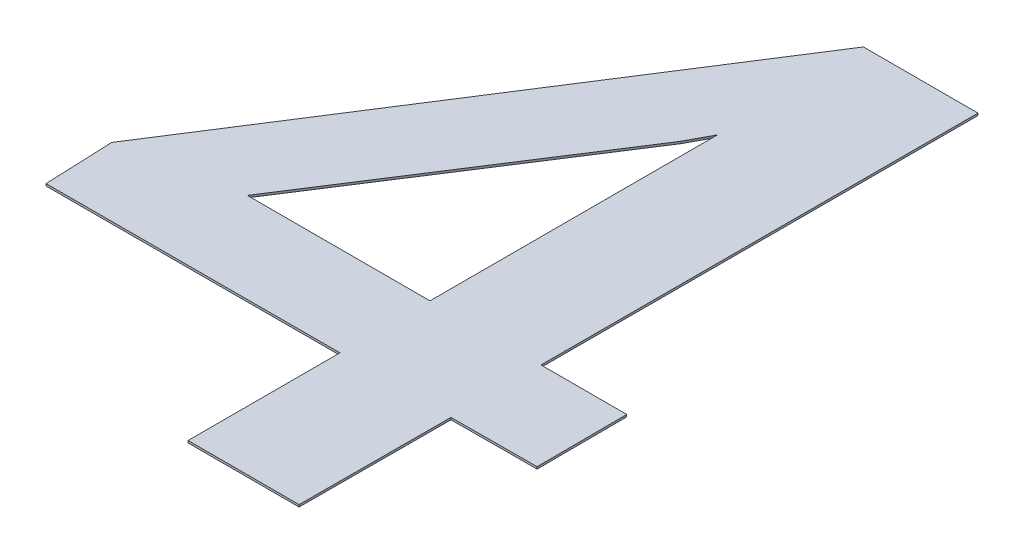
ISO-10303-21;
HEADER;
FILE_DESCRIPTION(('STEP AP214'),'2;1');
FILE_NAME('part.step','',(''),(''),'','','');
FILE_SCHEMA(('AUTOMOTIVE_DESIGN { 1 0 10303 214 1 1 1 1 }'));
ENDSEC;
DATA;
#1=APPLICATION_CONTEXT('core data for automotive mechanical design processes');
#2=APPLICATION_PROTOCOL_DEFINITION('international standard','automotive_design',2000,#1);
#3=PRODUCT_CONTEXT('',#1,'mechanical');
#4=PRODUCT('Part','Part','',(#3));
#5=PRODUCT_RELATED_PRODUCT_CATEGORY('part','',(#4));
#6=PRODUCT_DEFINITION_FORMATION('','',#4);
#7=PRODUCT_DEFINITION_CONTEXT('part definition',#1,'design');
#8=PRODUCT_DEFINITION('design','',#6,#7);
#9=PRODUCT_DEFINITION_SHAPE('','',#8);
#10=(LENGTH_UNIT() NAMED_UNIT(*) SI_UNIT(.MILLI.,.METRE.));
#11=(NAMED_UNIT(*) PLANE_ANGLE_UNIT() SI_UNIT($,.RADIAN.));
#12=(NAMED_UNIT(*) SI_UNIT($,.STERADIAN.) SOLID_ANGLE_UNIT());
#13=UNCERTAINTY_MEASURE_WITH_UNIT(LENGTH_MEASURE(1.E-05),#10,'distance_accuracy_value','');
#14=(GEOMETRIC_REPRESENTATION_CONTEXT(3) GLOBAL_UNCERTAINTY_ASSIGNED_CONTEXT((#13)) GLOBAL_UNIT_ASSIGNED_CONTEXT((#10,
#11,#12)) REPRESENTATION_CONTEXT('',''));
#15=CARTESIAN_POINT('',(0.,0.,0.));
#16=DIRECTION('',(0.,0.,1.));
#17=DIRECTION('',(1.,0.,0.));
#18=AXIS2_PLACEMENT_3D('',#15,#16,#17);
#19=CARTESIAN_POINT('',(-11.16231131397,6.01,9.773928150074));
#20=DIRECTION('',(-0.840562114855149,0.,-0.541715175226096));
#21=DIRECTION('',(-0.541715175226096,0.,0.840562114855149));
#22=AXIS2_PLACEMENT_3D('',#19,#20,#21);
#23=PLANE('',#22);
#24=DIRECTION('',(0.541715175226096,0.,-0.840562114855149));
#25=VECTOR('',#24,1.);
#26=CARTESIAN_POINT('',(-11.16231131397,6.,9.773928150074));
#27=LINE('',#26,#25);
#28=CARTESIAN_POINT('',(-11.16231131397,6.,9.773928150074));
#29=VERTEX_POINT('',#28);
#30=CARTESIAN_POINT('',(-10.36823825739,6.,8.541790380437));
#31=VERTEX_POINT('',#30);
#32=EDGE_CURVE('E144',#29,#31,#27,.T.);
#33=ORIENTED_EDGE('',*,*,#32,.T.);
#34=DIRECTION('',(0.,-1.,0.));
#35=VECTOR('',#34,1.);
#36=CARTESIAN_POINT('',(-10.36823825739,6.01,8.541790380437));
#37=LINE('',#36,#35);
#38=CARTESIAN_POINT('',(-10.36823825739,6.01,8.541790380437));
#39=VERTEX_POINT('',#38);
#40=EDGE_CURVE('E11',#39,#31,#37,.T.);
#41=ORIENTED_EDGE('',*,*,#40,.F.);
#42=DIRECTION('',(0.541715175226096,0.,-0.840562114855149));
#43=VECTOR('',#42,1.);
#44=CARTESIAN_POINT('',(-11.16231131397,6.01,9.773928150074));
#45=LINE('',#44,#43);
#46=CARTESIAN_POINT('',(-11.16231131397,6.01,9.773928150074));
#47=VERTEX_POINT('',#46);
#48=EDGE_CURVE('E146',#47,#39,#45,.T.);
#49=ORIENTED_EDGE('',*,*,#48,.F.);
#50=DIRECTION('',(0.,-1.,0.));
#51=VECTOR('',#50,1.);
#52=CARTESIAN_POINT('',(-11.16231131397,6.01,9.773928150074));
#53=LINE('',#52,#51);
#54=EDGE_CURVE('E118',#47,#29,#53,.T.);
#55=ORIENTED_EDGE('',*,*,#54,.T.);
#56=EDGE_LOOP('',(#33,#41,#49,#55));
#57=FACE_BOUND('',#56,.T.);
#58=ADVANCED_FACE('F16',(#57),#23,.F.);
#59=CARTESIAN_POINT('',(-10.36823825739,6.01,8.541790380437));
#60=DIRECTION('',(-0.880955569015077,0.,-0.473198991357042));
#61=DIRECTION('',(-0.473198991357042,0.,0.880955569015077));
#62=AXIS2_PLACEMENT_3D('',#59,#60,#61);
#63=PLANE('',#62);
#64=DIRECTION('',(0.473198991357042,0.,-0.880955569015077));
#65=VECTOR('',#64,1.);
#66=CARTESIAN_POINT('',(-10.36823825739,6.,8.541790380437));
#67=LINE('',#66,#65);
#68=CARTESIAN_POINT('',(-10.30750362166,6.,8.428720579867));
#69=VERTEX_POINT('',#68);
#70=EDGE_CURVE('E150',#31,#69,#67,.T.);
#71=ORIENTED_EDGE('',*,*,#70,.T.);
#72=DIRECTION('',(0.,-1.,0.));
#73=VECTOR('',#72,1.);
#74=CARTESIAN_POINT('',(-10.30750362166,6.01,8.428720579867));
#75=LINE('',#74,#73);
#76=CARTESIAN_POINT('',(-10.30750362166,6.01,8.428720579867));
#77=VERTEX_POINT('',#76);
#78=EDGE_CURVE('E27',#77,#69,#75,.T.);
#79=ORIENTED_EDGE('',*,*,#78,.F.);
#80=DIRECTION('',(0.473198991357042,0.,-0.880955569015077));
#81=VECTOR('',#80,1.);
#82=CARTESIAN_POINT('',(-10.36823825739,6.01,8.541790380437));
#83=LINE('',#82,#81);
#84=EDGE_CURVE('E170',#39,#77,#83,.T.);
#85=ORIENTED_EDGE('',*,*,#84,.F.);
#86=ORIENTED_EDGE('',*,*,#40,.T.);
#87=EDGE_LOOP('',(#71,#79,#85,#86));
#88=FACE_BOUND('',#87,.T.);
#89=ADVANCED_FACE('F401',(#88),#63,.F.);
#90=CARTESIAN_POINT('',(-10.30750362166,6.01,8.428720579867));
#91=DIRECTION('',(1.,0.,0.));
#92=DIRECTION('',(0.,1.,0.));
#93=AXIS2_PLACEMENT_3D('',#90,#91,#92);
#94=PLANE('',#93);
#95=DIRECTION('',(0.,0.,1.));
#96=VECTOR('',#95,1.);
#97=CARTESIAN_POINT('',(-10.30750362166,6.,8.428720579867));
#98=LINE('',#97,#96);
#99=CARTESIAN_POINT('',(-10.30750362166,6.,9.773928150074));
#100=VERTEX_POINT('',#99);
#101=EDGE_CURVE('E158',#69,#100,#98,.T.);
#102=ORIENTED_EDGE('',*,*,#101,.T.);
#103=DIRECTION('',(0.,-1.,0.));
#104=VECTOR('',#103,1.);
#105=CARTESIAN_POINT('',(-10.30750362166,6.01,9.773928150074));
#106=LINE('',#105,#104);
#107=CARTESIAN_POINT('',(-10.30750362166,6.01,9.773928150074));
#108=VERTEX_POINT('',#107);
#109=EDGE_CURVE('E149',#108,#100,#106,.T.);
#110=ORIENTED_EDGE('',*,*,#109,.F.);
#111=DIRECTION('',(0.,0.,1.));
#112=VECTOR('',#111,1.);
#113=CARTESIAN_POINT('',(-10.30750362166,6.01,8.428720579867));
#114=LINE('',#113,#112);
#115=EDGE_CURVE('E163',#77,#108,#114,.T.);
#116=ORIENTED_EDGE('',*,*,#115,.F.);
#117=ORIENTED_EDGE('',*,*,#78,.T.);
#118=EDGE_LOOP('',(#102,#110,#116,#117));
#119=FACE_BOUND('',#118,.T.);
#120=ADVANCED_FACE('F407',(#119),#94,.F.);
#121=CARTESIAN_POINT('',(-10.30750362166,6.01,9.773928150074));
#122=DIRECTION('',(0.,0.,1.));
#123=DIRECTION('',(1.,0.,0.));
#124=AXIS2_PLACEMENT_3D('',#121,#122,#123);
#125=PLANE('',#124);
#126=DIRECTION('',(-1.,0.,0.));
#127=VECTOR('',#126,1.);
#128=CARTESIAN_POINT('',(-10.30750362166,6.,9.773928150074));
#129=LINE('',#128,#127);
#130=EDGE_CURVE('E153',#100,#29,#129,.T.);
#131=ORIENTED_EDGE('',*,*,#130,.T.);
#132=ORIENTED_EDGE('',*,*,#54,.F.);
#133=DIRECTION('',(-1.,0.,0.));
#134=VECTOR('',#133,1.);
#135=CARTESIAN_POINT('',(-10.30750362166,6.01,9.773928150074));
#136=LINE('',#135,#134);
#137=EDGE_CURVE('E279',#108,#47,#136,.T.);
#138=ORIENTED_EDGE('',*,*,#137,.F.);
#139=ORIENTED_EDGE('',*,*,#109,.T.);
#140=EDGE_LOOP('',(#131,#132,#138,#139));
#141=FACE_BOUND('',#140,.T.);
#142=ADVANCED_FACE('F154',(#141),#125,.F.);
#143=CARTESIAN_POINT('',(0.,6.,0.));
#144=DIRECTION('',(0.,1.,0.));
#145=DIRECTION('',(1.,0.,0.));
#146=AXIS2_PLACEMENT_3D('',#143,#144,#145);
#147=PLANE('',#146);
#148=DIRECTION('',(-1.,0.,0.));
#149=VECTOR('',#148,1.);
#150=CARTESIAN_POINT('',(-9.386792388453,6.,9.773928150074));
#151=LINE('',#150,#149);
#152=CARTESIAN_POINT('',(-9.386792388453,6.,9.773928150074));
#153=VERTEX_POINT('',#152);
#154=CARTESIAN_POINT('',(-9.788028652189,6.,9.773928150074));
#155=VERTEX_POINT('',#154);
#156=EDGE_CURVE('E203',#153,#155,#151,.T.);
#157=ORIENTED_EDGE('',*,*,#156,.F.);
#158=DIRECTION('',(-0.00460117828768172,0.,-0.999989414523156));
#159=VECTOR('',#158,1.);
#160=CARTESIAN_POINT('',(-9.384854049014,6.,10.19519392134));
#161=LINE('',#160,#159);
#162=CARTESIAN_POINT('',(-9.384854049014,6.,10.19519392134));
#163=VERTEX_POINT('',#162);
#164=EDGE_CURVE('E316',#163,#153,#161,.T.);
#165=ORIENTED_EDGE('',*,*,#164,.F.);
#166=DIRECTION('',(0.999988331320486,0.,-0.00483086150396335));
#167=VECTOR('',#166,1.);
#168=CARTESIAN_POINT('',(-9.78609031275,6.,10.197132260779));
#169=LINE('',#168,#167);
#170=CARTESIAN_POINT('',(-9.78609031275,6.,10.197132260779));
#171=VERTEX_POINT('',#170);
#172=EDGE_CURVE('E186',#171,#163,#169,.T.);
#173=ORIENTED_EDGE('',*,*,#172,.F.);
#174=DIRECTION('',(0.00273472085864179,0.,-0.999996260643921));
#175=VECTOR('',#174,1.);
#176=CARTESIAN_POINT('',(-9.788028652189,6.,10.905918382065));
#177=LINE('',#176,#175);
#178=CARTESIAN_POINT('',(-9.788028652189,6.,10.905918382065));
#179=VERTEX_POINT('',#178);
#180=EDGE_CURVE('E190',#179,#171,#177,.T.);
#181=ORIENTED_EDGE('',*,*,#180,.F.);
#182=DIRECTION('',(1.,0.,0.));
#183=VECTOR('',#182,1.);
#184=CARTESIAN_POINT('',(-10.30750362166,6.,10.905918382065));
#185=LINE('',#184,#183);
#186=CARTESIAN_POINT('',(-10.30750362166,6.,10.905918382065));
#187=VERTEX_POINT('',#186);
#188=EDGE_CURVE('E230',#187,#179,#185,.T.);
#189=ORIENTED_EDGE('',*,*,#188,.F.);
#190=DIRECTION('',(0.,0.,1.));
#191=VECTOR('',#190,1.);
#192=CARTESIAN_POINT('',(-10.30750362166,6.,10.19519392134));
#193=LINE('',#192,#191);
#194=CARTESIAN_POINT('',(-10.30750362166,6.,10.19519392134));
#195=VERTEX_POINT('',#194);
#196=EDGE_CURVE('E197',#195,#187,#193,.T.);
#197=ORIENTED_EDGE('',*,*,#196,.F.);
#198=DIRECTION('',(0.999999004398953,0.,-0.00141109925361993));
#199=VECTOR('',#198,1.);
#200=CARTESIAN_POINT('',(-11.6811401703,6.,10.197132260779));
#201=LINE('',#200,#199);
#202=CARTESIAN_POINT('',(-11.6811401703,6.,10.197132260779));
#203=VERTEX_POINT('',#202);
#204=EDGE_CURVE('E250',#203,#195,#201,.T.);
#205=ORIENTED_EDGE('',*,*,#204,.F.);
#206=DIRECTION('',(0.0402898401108255,0.,0.999188034748137));
#207=VECTOR('',#206,1.);
#208=CARTESIAN_POINT('',(-11.69406243322,6.,9.876660140306));
#209=LINE('',#208,#207);
#210=CARTESIAN_POINT('',(-11.69406243322,6.,9.876660140306));
#211=VERTEX_POINT('',#210);
#212=EDGE_CURVE('E174',#211,#203,#209,.T.);
#213=ORIENTED_EDGE('',*,*,#212,.F.);
#214=DIRECTION('',(-0.538614463983158,0.,0.842552348040248));
#215=VECTOR('',#214,1.);
#216=CARTESIAN_POINT('',(-10.32236422402,6.,7.730918382065));
#217=LINE('',#216,#215);
#218=CARTESIAN_POINT('',(-10.32236422402,6.,7.730918382065));
#219=VERTEX_POINT('',#218);
#220=EDGE_CURVE('E255',#219,#211,#217,.T.);
#221=ORIENTED_EDGE('',*,*,#220,.F.);
#222=DIRECTION('',(-1.,0.,0.));
#223=VECTOR('',#222,1.);
#224=CARTESIAN_POINT('',(-9.78609031275,6.,7.730918382065));
#225=LINE('',#224,#223);
#226=CARTESIAN_POINT('',(-9.78609031275,6.,7.730918382065));
#227=VERTEX_POINT('',#226);
#228=EDGE_CURVE('E176',#227,#219,#225,.T.);
#229=ORIENTED_EDGE('',*,*,#228,.F.);
#230=DIRECTION('',(0.000948766176395656,0.,-0.99999954992127));
#231=VECTOR('',#230,1.);
#232=CARTESIAN_POINT('',(-9.788028652189,6.,9.773928150074));
#233=LINE('',#232,#231);
#234=EDGE_CURVE('E318',#155,#227,#233,.T.);
#235=ORIENTED_EDGE('',*,*,#234,.F.);
#236=EDGE_LOOP('',(#157,#165,#173,#181,#189,#197,#205,#213,#221,#229,#235));
#237=FACE_BOUND('',#236,.T.);
#238=ORIENTED_EDGE('',*,*,#32,.F.);
#239=ORIENTED_EDGE('',*,*,#130,.F.);
#240=ORIENTED_EDGE('',*,*,#101,.F.);
#241=ORIENTED_EDGE('',*,*,#70,.F.);
#242=EDGE_LOOP('',(#238,#239,#240,#241));
#243=FACE_BOUND('',#242,.T.);
#244=ADVANCED_FACE('F161',(#237,#243),#147,.F.);
#245=CARTESIAN_POINT('',(0.,6.01,0.));
#246=DIRECTION('',(0.,1.,0.));
#247=DIRECTION('',(1.,0.,0.));
#248=AXIS2_PLACEMENT_3D('',#245,#246,#247);
#249=PLANE('',#248);
#250=DIRECTION('',(-1.,0.,0.));
#251=VECTOR('',#250,1.);
#252=CARTESIAN_POINT('',(-9.386792388453,6.01,9.773928150074));
#253=LINE('',#252,#251);
#254=CARTESIAN_POINT('',(-9.386792388453,6.01,9.773928150074));
#255=VERTEX_POINT('',#254);
#256=CARTESIAN_POINT('',(-9.788028652189,6.01,9.773928150074));
#257=VERTEX_POINT('',#256);
#258=EDGE_CURVE('E198',#255,#257,#253,.T.);
#259=ORIENTED_EDGE('',*,*,#258,.T.);
#260=DIRECTION('',(0.000948766176395656,0.,-0.99999954992127));
#261=VECTOR('',#260,1.);
#262=CARTESIAN_POINT('',(-9.788028652189,6.01,9.773928150074));
#263=LINE('',#262,#261);
#264=CARTESIAN_POINT('',(-9.78609031275,6.01,7.730918382065));
#265=VERTEX_POINT('',#264);
#266=EDGE_CURVE('E180',#257,#265,#263,.T.);
#267=ORIENTED_EDGE('',*,*,#266,.T.);
#268=DIRECTION('',(-1.,0.,0.));
#269=VECTOR('',#268,1.);
#270=CARTESIAN_POINT('',(-9.78609031275,6.01,7.730918382065));
#271=LINE('',#270,#269);
#272=CARTESIAN_POINT('',(-10.32236422402,6.01,7.730918382065));
#273=VERTEX_POINT('',#272);
#274=EDGE_CURVE('E259',#265,#273,#271,.T.);
#275=ORIENTED_EDGE('',*,*,#274,.T.);
#276=DIRECTION('',(-0.538614463983158,0.,0.842552348040248));
#277=VECTOR('',#276,1.);
#278=CARTESIAN_POINT('',(-10.32236422402,6.01,7.730918382065));
#279=LINE('',#278,#277);
#280=CARTESIAN_POINT('',(-11.69406243322,6.01,9.876660140306));
#281=VERTEX_POINT('',#280);
#282=EDGE_CURVE('E280',#273,#281,#279,.T.);
#283=ORIENTED_EDGE('',*,*,#282,.T.);
#284=DIRECTION('',(0.0402898401108255,0.,0.999188034748137));
#285=VECTOR('',#284,1.);
#286=CARTESIAN_POINT('',(-11.69406243322,6.01,9.876660140306));
#287=LINE('',#286,#285);
#288=CARTESIAN_POINT('',(-11.6811401703,6.01,10.197132260779));
#289=VERTEX_POINT('',#288);
#290=EDGE_CURVE('E268',#281,#289,#287,.T.);
#291=ORIENTED_EDGE('',*,*,#290,.T.);
#292=DIRECTION('',(0.999999004398953,0.,-0.00141109925361993));
#293=VECTOR('',#292,1.);
#294=CARTESIAN_POINT('',(-11.6811401703,6.01,10.197132260779));
#295=LINE('',#294,#293);
#296=CARTESIAN_POINT('',(-10.30750362166,6.01,10.19519392134));
#297=VERTEX_POINT('',#296);
#298=EDGE_CURVE('E233',#289,#297,#295,.T.);
#299=ORIENTED_EDGE('',*,*,#298,.T.);
#300=DIRECTION('',(0.,0.,1.));
#301=VECTOR('',#300,1.);
#302=CARTESIAN_POINT('',(-10.30750362166,6.01,10.19519392134));
#303=LINE('',#302,#301);
#304=CARTESIAN_POINT('',(-10.30750362166,6.01,10.905918382065));
#305=VERTEX_POINT('',#304);
#306=EDGE_CURVE('E196',#297,#305,#303,.T.);
#307=ORIENTED_EDGE('',*,*,#306,.T.);
#308=DIRECTION('',(1.,0.,0.));
#309=VECTOR('',#308,1.);
#310=CARTESIAN_POINT('',(-10.30750362166,6.01,10.905918382065));
#311=LINE('',#310,#309);
#312=CARTESIAN_POINT('',(-9.788028652189,6.01,10.905918382065));
#313=VERTEX_POINT('',#312);
#314=EDGE_CURVE('E300',#305,#313,#311,.T.);
#315=ORIENTED_EDGE('',*,*,#314,.T.);
#316=DIRECTION('',(0.00273472085864179,0.,-0.999996260643921));
#317=VECTOR('',#316,1.);
#318=CARTESIAN_POINT('',(-9.788028652189,6.01,10.905918382065));
#319=LINE('',#318,#317);
#320=CARTESIAN_POINT('',(-9.78609031275,6.01,10.197132260779));
#321=VERTEX_POINT('',#320);
#322=EDGE_CURVE('E20',#313,#321,#319,.T.);
#323=ORIENTED_EDGE('',*,*,#322,.T.);
#324=DIRECTION('',(0.999988331320486,0.,-0.00483086150396335));
#325=VECTOR('',#324,1.);
#326=CARTESIAN_POINT('',(-9.78609031275,6.01,10.197132260779));
#327=LINE('',#326,#325);
#328=CARTESIAN_POINT('',(-9.384854049014,6.01,10.19519392134));
#329=VERTEX_POINT('',#328);
#330=EDGE_CURVE('E185',#321,#329,#327,.T.);
#331=ORIENTED_EDGE('',*,*,#330,.T.);
#332=DIRECTION('',(-0.00460117828768172,0.,-0.999989414523156));
#333=VECTOR('',#332,1.);
#334=CARTESIAN_POINT('',(-9.384854049014,6.01,10.19519392134));
#335=LINE('',#334,#333);
#336=EDGE_CURVE('E333',#329,#255,#335,.T.);
#337=ORIENTED_EDGE('',*,*,#336,.T.);
#338=EDGE_LOOP('',(#259,#267,#275,#283,#291,#299,#307,#315,#323,#331,#337));
#339=FACE_BOUND('',#338,.T.);
#340=ORIENTED_EDGE('',*,*,#137,.T.);
#341=ORIENTED_EDGE('',*,*,#48,.T.);
#342=ORIENTED_EDGE('',*,*,#84,.T.);
#343=ORIENTED_EDGE('',*,*,#115,.T.);
#344=EDGE_LOOP('',(#340,#341,#342,#343));
#345=FACE_BOUND('',#344,.T.);
#346=ADVANCED_FACE('F344',(#339,#345),#249,.T.);
#347=CARTESIAN_POINT('',(-9.384854049014,6.01,10.19519392134));
#348=DIRECTION('',(-0.999989414523156,0.,0.00460117828768172));
#349=DIRECTION('',(0.,1.,0.));
#350=AXIS2_PLACEMENT_3D('',#347,#348,#349);
#351=PLANE('',#350);
#352=ORIENTED_EDGE('',*,*,#164,.T.);
#353=DIRECTION('',(0.,-1.,0.));
#354=VECTOR('',#353,1.);
#355=CARTESIAN_POINT('',(-9.386792388453,6.01,9.773928150074));
#356=LINE('',#355,#354);
#357=EDGE_CURVE('E201',#255,#153,#356,.T.);
#358=ORIENTED_EDGE('',*,*,#357,.F.);
#359=ORIENTED_EDGE('',*,*,#336,.F.);
#360=DIRECTION('',(0.,-1.,0.));
#361=VECTOR('',#360,1.);
#362=CARTESIAN_POINT('',(-9.384854049014,6.01,10.19519392134));
#363=LINE('',#362,#361);
#364=EDGE_CURVE('E181',#329,#163,#363,.T.);
#365=ORIENTED_EDGE('',*,*,#364,.T.);
#366=EDGE_LOOP('',(#352,#358,#359,#365));
#367=FACE_BOUND('',#366,.T.);
#368=ADVANCED_FACE('F352',(#367),#351,.F.);
#369=CARTESIAN_POINT('',(-9.78609031275,6.01,10.197132260779));
#370=DIRECTION('',(-0.00483086150396335,0.,-0.999988331320486));
#371=DIRECTION('',(-0.999988331320486,0.,0.00483086150396335));
#372=AXIS2_PLACEMENT_3D('',#369,#370,#371);
#373=PLANE('',#372);
#374=ORIENTED_EDGE('',*,*,#172,.T.);
#375=ORIENTED_EDGE('',*,*,#364,.F.);
#376=ORIENTED_EDGE('',*,*,#330,.F.);
#377=DIRECTION('',(0.,-1.,0.));
#378=VECTOR('',#377,1.);
#379=CARTESIAN_POINT('',(-9.78609031275,6.01,10.197132260779));
#380=LINE('',#379,#378);
#381=EDGE_CURVE('E187',#321,#171,#380,.T.);
#382=ORIENTED_EDGE('',*,*,#381,.T.);
#383=EDGE_LOOP('',(#374,#375,#376,#382));
#384=FACE_BOUND('',#383,.T.);
#385=ADVANCED_FACE('F350',(#384),#373,.F.);
#386=CARTESIAN_POINT('',(-9.788028652189,6.01,10.905918382065));
#387=DIRECTION('',(-0.999996260643921,0.,-0.00273472085864179));
#388=DIRECTION('',(-0.00273472085864179,0.,0.999996260643921));
#389=AXIS2_PLACEMENT_3D('',#386,#387,#388);
#390=PLANE('',#389);
#391=ORIENTED_EDGE('',*,*,#180,.T.);
#392=ORIENTED_EDGE('',*,*,#381,.F.);
#393=ORIENTED_EDGE('',*,*,#322,.F.);
#394=DIRECTION('',(0.,-1.,0.));
#395=VECTOR('',#394,1.);
#396=CARTESIAN_POINT('',(-9.788028652189,6.01,10.905918382065));
#397=LINE('',#396,#395);
#398=EDGE_CURVE('E222',#313,#179,#397,.T.);
#399=ORIENTED_EDGE('',*,*,#398,.T.);
#400=EDGE_LOOP('',(#391,#392,#393,#399));
#401=FACE_BOUND('',#400,.T.);
#402=ADVANCED_FACE('F429',(#401),#390,.F.);
#403=CARTESIAN_POINT('',(-10.30750362166,6.01,10.905918382065));
#404=DIRECTION('',(0.,0.,-1.));
#405=DIRECTION('',(0.,-1.,0.));
#406=AXIS2_PLACEMENT_3D('',#403,#404,#405);
#407=PLANE('',#406);
#408=ORIENTED_EDGE('',*,*,#188,.T.);
#409=ORIENTED_EDGE('',*,*,#398,.F.);
#410=ORIENTED_EDGE('',*,*,#314,.F.);
#411=DIRECTION('',(0.,-1.,0.));
#412=VECTOR('',#411,1.);
#413=CARTESIAN_POINT('',(-10.30750362166,6.01,10.905918382065));
#414=LINE('',#413,#412);
#415=EDGE_CURVE('E192',#305,#187,#414,.T.);
#416=ORIENTED_EDGE('',*,*,#415,.T.);
#417=EDGE_LOOP('',(#408,#409,#410,#416));
#418=FACE_BOUND('',#417,.T.);
#419=ADVANCED_FACE('F372',(#418),#407,.F.);
#420=CARTESIAN_POINT('',(-10.30750362166,6.01,10.19519392134));
#421=DIRECTION('',(1.,0.,0.));
#422=DIRECTION('',(0.,1.,0.));
#423=AXIS2_PLACEMENT_3D('',#420,#421,#422);
#424=PLANE('',#423);
#425=ORIENTED_EDGE('',*,*,#196,.T.);
#426=ORIENTED_EDGE('',*,*,#415,.F.);
#427=ORIENTED_EDGE('',*,*,#306,.F.);
#428=DIRECTION('',(0.,-1.,0.));
#429=VECTOR('',#428,1.);
#430=CARTESIAN_POINT('',(-10.30750362166,6.01,10.19519392134));
#431=LINE('',#430,#429);
#432=EDGE_CURVE('E240',#297,#195,#431,.T.);
#433=ORIENTED_EDGE('',*,*,#432,.T.);
#434=EDGE_LOOP('',(#425,#426,#427,#433));
#435=FACE_BOUND('',#434,.T.);
#436=ADVANCED_FACE('F373',(#435),#424,.F.);
#437=CARTESIAN_POINT('',(-11.6811401703,6.01,10.197132260779));
#438=DIRECTION('',(-0.00141109925361993,0.,-0.999999004398953));
#439=DIRECTION('',(-0.999999004398953,0.,0.00141109925361993));
#440=AXIS2_PLACEMENT_3D('',#437,#438,#439);
#441=PLANE('',#440);
#442=ORIENTED_EDGE('',*,*,#204,.T.);
#443=ORIENTED_EDGE('',*,*,#432,.F.);
#444=ORIENTED_EDGE('',*,*,#298,.F.);
#445=DIRECTION('',(0.,-1.,0.));
#446=VECTOR('',#445,1.);
#447=CARTESIAN_POINT('',(-11.6811401703,6.01,10.197132260779));
#448=LINE('',#447,#446);
#449=EDGE_CURVE('E264',#289,#203,#448,.T.);
#450=ORIENTED_EDGE('',*,*,#449,.T.);
#451=EDGE_LOOP('',(#442,#443,#444,#450));
#452=FACE_BOUND('',#451,.T.);
#453=ADVANCED_FACE('F375',(#452),#441,.F.);
#454=CARTESIAN_POINT('',(-11.69406243322,6.01,9.876660140306));
#455=DIRECTION('',(0.999188034748137,0.,-0.0402898401108255));
#456=DIRECTION('',(0.,-1.,0.));
#457=AXIS2_PLACEMENT_3D('',#454,#455,#456);
#458=PLANE('',#457);
#459=ORIENTED_EDGE('',*,*,#212,.T.);
#460=ORIENTED_EDGE('',*,*,#449,.F.);
#461=ORIENTED_EDGE('',*,*,#290,.F.);
#462=DIRECTION('',(0.,-1.,0.));
#463=VECTOR('',#462,1.);
#464=CARTESIAN_POINT('',(-11.69406243322,6.01,9.876660140306));
#465=LINE('',#464,#463);
#466=EDGE_CURVE('E258',#281,#211,#465,.T.);
#467=ORIENTED_EDGE('',*,*,#466,.T.);
#468=EDGE_LOOP('',(#459,#460,#461,#467));
#469=FACE_BOUND('',#468,.T.);
#470=ADVANCED_FACE('F18',(#469),#458,.F.);
#471=CARTESIAN_POINT('',(-10.32236422402,6.01,7.730918382065));
#472=DIRECTION('',(0.842552348040248,0.,0.538614463983158));
#473=DIRECTION('',(0.,-1.,0.));
#474=AXIS2_PLACEMENT_3D('',#471,#472,#473);
#475=PLANE('',#474);
#476=ORIENTED_EDGE('',*,*,#220,.T.);
#477=ORIENTED_EDGE('',*,*,#466,.F.);
#478=ORIENTED_EDGE('',*,*,#282,.F.);
#479=DIRECTION('',(0.,-1.,0.));
#480=VECTOR('',#479,1.);
#481=CARTESIAN_POINT('',(-10.32236422402,6.01,7.730918382065));
#482=LINE('',#481,#480);
#483=EDGE_CURVE('E179',#273,#219,#482,.T.);
#484=ORIENTED_EDGE('',*,*,#483,.T.);
#485=EDGE_LOOP('',(#476,#477,#478,#484));
#486=FACE_BOUND('',#485,.T.);
#487=ADVANCED_FACE('F381',(#486),#475,.F.);
#488=CARTESIAN_POINT('',(-9.78609031275,6.01,7.730918382065));
#489=DIRECTION('',(0.,0.,1.));
#490=DIRECTION('',(1.,0.,0.));
#491=AXIS2_PLACEMENT_3D('',#488,#489,#490);
#492=PLANE('',#491);
#493=ORIENTED_EDGE('',*,*,#228,.T.);
#494=ORIENTED_EDGE('',*,*,#483,.F.);
#495=ORIENTED_EDGE('',*,*,#274,.F.);
#496=DIRECTION('',(0.,-1.,0.));
#497=VECTOR('',#496,1.);
#498=CARTESIAN_POINT('',(-9.78609031275,6.01,7.730918382065));
#499=LINE('',#498,#497);
#500=EDGE_CURVE('E263',#265,#227,#499,.T.);
#501=ORIENTED_EDGE('',*,*,#500,.T.);
#502=EDGE_LOOP('',(#493,#494,#495,#501));
#503=FACE_BOUND('',#502,.T.);
#504=ADVANCED_FACE('F358',(#503),#492,.F.);
#505=CARTESIAN_POINT('',(-9.788028652189,6.01,9.773928150074));
#506=DIRECTION('',(-0.99999954992127,0.,-0.000948766176395656));
#507=DIRECTION('',(-0.000948766176395656,0.,0.99999954992127));
#508=AXIS2_PLACEMENT_3D('',#505,#506,#507);
#509=PLANE('',#508);
#510=ORIENTED_EDGE('',*,*,#234,.T.);
#511=ORIENTED_EDGE('',*,*,#500,.F.);
#512=ORIENTED_EDGE('',*,*,#266,.F.);
#513=DIRECTION('',(0.,-1.,0.));
#514=VECTOR('',#513,1.);
#515=CARTESIAN_POINT('',(-9.788028652189,6.01,9.773928150074));
#516=LINE('',#515,#514);
#517=EDGE_CURVE('E202',#257,#155,#516,.T.);
#518=ORIENTED_EDGE('',*,*,#517,.T.);
#519=EDGE_LOOP('',(#510,#511,#512,#518));
#520=FACE_BOUND('',#519,.T.);
#521=ADVANCED_FACE('F388',(#520),#509,.F.);
#522=CARTESIAN_POINT('',(-9.386792388453,6.01,9.773928150074));
#523=DIRECTION('',(0.,0.,1.));
#524=DIRECTION('',(1.,0.,0.));
#525=AXIS2_PLACEMENT_3D('',#522,#523,#524);
#526=PLANE('',#525);
#527=ORIENTED_EDGE('',*,*,#156,.T.);
#528=ORIENTED_EDGE('',*,*,#517,.F.);
#529=ORIENTED_EDGE('',*,*,#258,.F.);
#530=ORIENTED_EDGE('',*,*,#357,.T.);
#531=EDGE_LOOP('',(#527,#528,#529,#530));
#532=FACE_BOUND('',#531,.T.);
#533=ADVANCED_FACE('F390',(#532),#526,.F.);
#534=CLOSED_SHELL('',(#58,#89,#120,#142,#244,#346,#368,#385,#402,#419,#436,#453,#470,#487,#504,
#521,#533));
#535=MANIFOLD_SOLID_BREP('B1',#534);
#536=ADVANCED_BREP_SHAPE_REPRESENTATION('',(#18,#535),#14);
#537=SHAPE_DEFINITION_REPRESENTATION(#9,#536);
ENDSEC;
END-ISO-10303-21;
